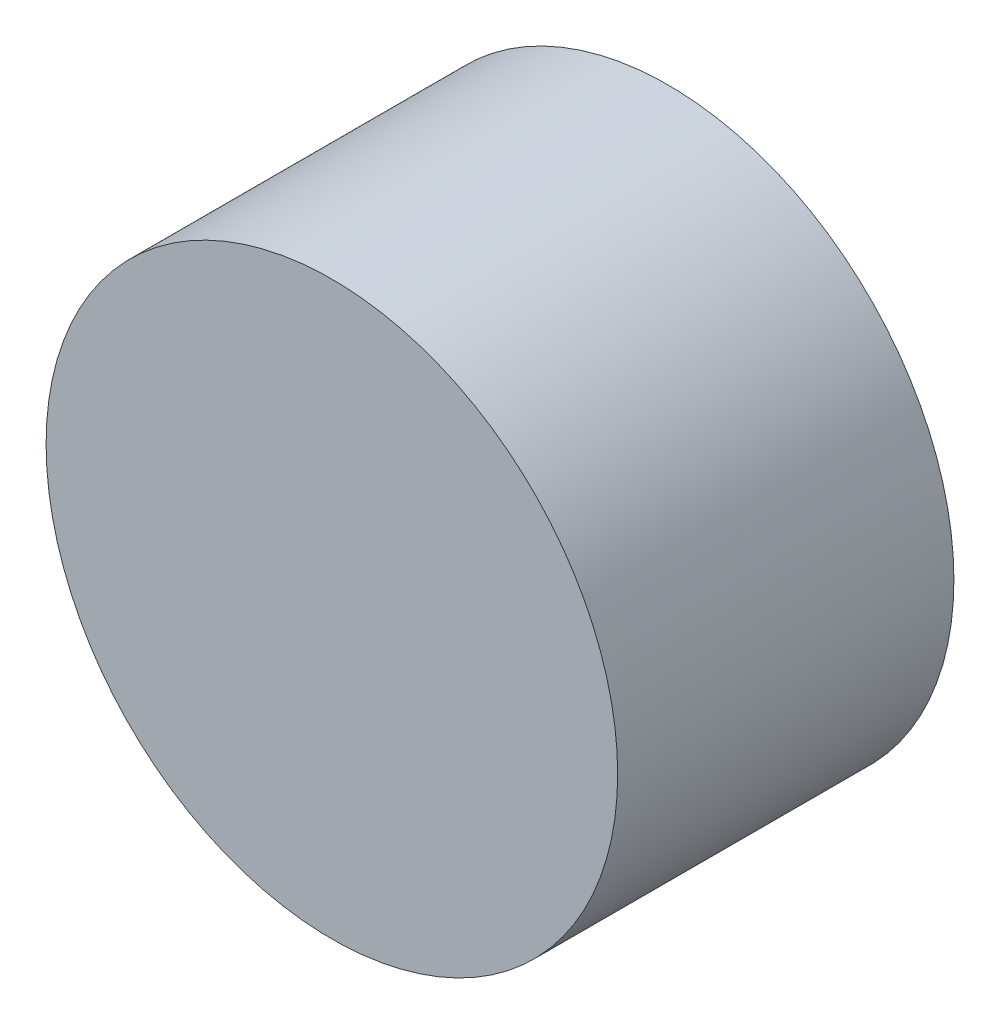
ISO-10303-21;
HEADER;
FILE_DESCRIPTION(('STEP AP214'),'2;1');
FILE_NAME('part.step','',(''),(''),'','','');
FILE_SCHEMA(('AUTOMOTIVE_DESIGN { 1 0 10303 214 1 1 1 1 }'));
ENDSEC;
DATA;
#1=APPLICATION_CONTEXT('core data for automotive mechanical design processes');
#2=APPLICATION_PROTOCOL_DEFINITION('international standard','automotive_design',2000,#1);
#3=PRODUCT_CONTEXT('',#1,'mechanical');
#4=PRODUCT('Part','Part','',(#3));
#5=PRODUCT_RELATED_PRODUCT_CATEGORY('part','',(#4));
#6=PRODUCT_DEFINITION_FORMATION('','',#4);
#7=PRODUCT_DEFINITION_CONTEXT('part definition',#1,'design');
#8=PRODUCT_DEFINITION('design','',#6,#7);
#9=PRODUCT_DEFINITION_SHAPE('','',#8);
#10=(LENGTH_UNIT() NAMED_UNIT(*) SI_UNIT(.MILLI.,.METRE.));
#11=(NAMED_UNIT(*) PLANE_ANGLE_UNIT() SI_UNIT($,.RADIAN.));
#12=(NAMED_UNIT(*) SI_UNIT($,.STERADIAN.) SOLID_ANGLE_UNIT());
#13=UNCERTAINTY_MEASURE_WITH_UNIT(LENGTH_MEASURE(1.E-05),#10,'distance_accuracy_value','');
#14=(GEOMETRIC_REPRESENTATION_CONTEXT(3) GLOBAL_UNCERTAINTY_ASSIGNED_CONTEXT((#13)) GLOBAL_UNIT_ASSIGNED_CONTEXT((#10,
#11,#12)) REPRESENTATION_CONTEXT('',''));
#15=CARTESIAN_POINT('',(0.,0.,0.));
#16=DIRECTION('',(0.,0.,1.));
#17=DIRECTION('',(1.,0.,0.));
#18=AXIS2_PLACEMENT_3D('',#15,#16,#17);
#19=CARTESIAN_POINT('',(0.85000084,0.,1.00000054));
#20=DIRECTION('',(0.,0.,-1.));
#21=DIRECTION('',(0.,-1.,0.));
#22=AXIS2_PLACEMENT_3D('',#19,#20,#21);
#23=PLANE('',#22);
#24=CARTESIAN_POINT('',(0.,0.,1.00000054));
#25=DIRECTION('',(0.,0.,1.));
#26=DIRECTION('',(1.,0.,0.));
#27=AXIS2_PLACEMENT_3D('',#24,#25,#26);
#28=CIRCLE('',#27,0.85000084);
#29=CARTESIAN_POINT('',(-0.85000084,0.,1.00000054));
#30=VERTEX_POINT('',#29);
#31=EDGE_CURVE('E11',#30,#30,#28,.T.);
#32=ORIENTED_EDGE('',*,*,#31,.T.);
#33=EDGE_LOOP('',(#32));
#34=FACE_BOUND('',#33,.T.);
#35=ADVANCED_FACE('F17',(#34),#23,.F.);
#36=CARTESIAN_POINT('',(0.85000084,0.,0.));
#37=DIRECTION('',(0.,0.,-1.));
#38=DIRECTION('',(0.,-1.,0.));
#39=AXIS2_PLACEMENT_3D('',#36,#37,#38);
#40=PLANE('',#39);
#41=CARTESIAN_POINT('',(0.,0.,0.));
#42=DIRECTION('',(0.,0.,1.));
#43=DIRECTION('',(1.,0.,0.));
#44=AXIS2_PLACEMENT_3D('',#41,#42,#43);
#45=CIRCLE('',#44,0.85000084);
#46=CARTESIAN_POINT('',(-0.85000084,0.,0.));
#47=VERTEX_POINT('',#46);
#48=EDGE_CURVE('E21',#47,#47,#45,.T.);
#49=ORIENTED_EDGE('',*,*,#48,.F.);
#50=EDGE_LOOP('',(#49));
#51=FACE_BOUND('',#50,.T.);
#52=ADVANCED_FACE('F19',(#51),#40,.T.);
#53=CARTESIAN_POINT('',(0.,0.,0.));
#54=DIRECTION('',(0.,0.,-1.));
#55=DIRECTION('',(1.,0.,0.));
#56=AXIS2_PLACEMENT_3D('',#53,#54,#55);
#57=CYLINDRICAL_SURFACE('',#56,0.85000084);
#58=ORIENTED_EDGE('',*,*,#48,.T.);
#59=DIRECTION('',(0.,0.,1.));
#60=VECTOR('',#59,1.);
#61=CARTESIAN_POINT('',(-0.85000084,0.,0.));
#62=LINE('',#61,#60);
#63=EDGE_CURVE('E28',#47,#30,#62,.T.);
#64=ORIENTED_EDGE('',*,*,#63,.T.);
#65=ORIENTED_EDGE('',*,*,#31,.F.);
#66=ORIENTED_EDGE('',*,*,#63,.F.);
#67=EDGE_LOOP('',(#58,#64,#65,#66));
#68=FACE_BOUND('',#67,.T.);
#69=ADVANCED_FACE('F43',(#68),#57,.T.);
#70=CLOSED_SHELL('',(#35,#52,#69));
#71=MANIFOLD_SOLID_BREP('B1',#70);
#72=ADVANCED_BREP_SHAPE_REPRESENTATION('',(#18,#71),#14);
#73=SHAPE_DEFINITION_REPRESENTATION(#9,#72);
ENDSEC;
END-ISO-10303-21;
